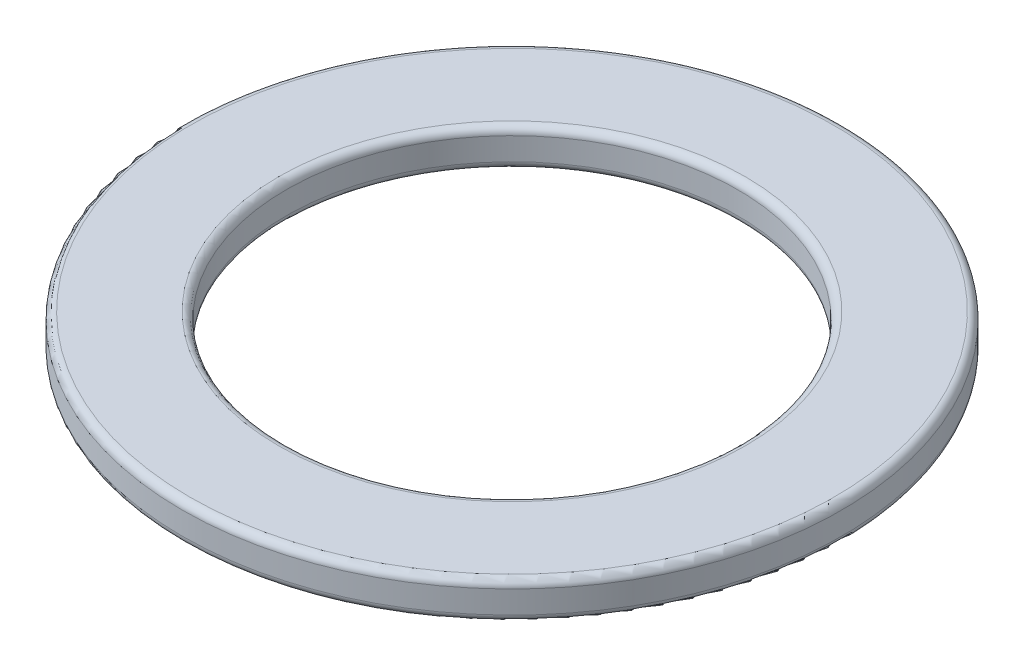
ISO-10303-21;
HEADER;
FILE_DESCRIPTION(('STEP AP214'),'2;1');
FILE_NAME('part.step','',(''),(''),'','','');
FILE_SCHEMA(('AUTOMOTIVE_DESIGN { 1 0 10303 214 1 1 1 1 }'));
ENDSEC;
DATA;
#1=APPLICATION_CONTEXT('core data for automotive mechanical design processes');
#2=APPLICATION_PROTOCOL_DEFINITION('international standard','automotive_design',2000,#1);
#3=PRODUCT_CONTEXT('',#1,'mechanical');
#4=PRODUCT('Part','Part','',(#3));
#5=PRODUCT_RELATED_PRODUCT_CATEGORY('part','',(#4));
#6=PRODUCT_DEFINITION_FORMATION('','',#4);
#7=PRODUCT_DEFINITION_CONTEXT('part definition',#1,'design');
#8=PRODUCT_DEFINITION('design','',#6,#7);
#9=PRODUCT_DEFINITION_SHAPE('','',#8);
#10=(LENGTH_UNIT() NAMED_UNIT(*) SI_UNIT(.MILLI.,.METRE.));
#11=(NAMED_UNIT(*) PLANE_ANGLE_UNIT() SI_UNIT($,.RADIAN.));
#12=(NAMED_UNIT(*) SI_UNIT($,.STERADIAN.) SOLID_ANGLE_UNIT());
#13=UNCERTAINTY_MEASURE_WITH_UNIT(LENGTH_MEASURE(1.E-05),#10,'distance_accuracy_value','');
#14=(GEOMETRIC_REPRESENTATION_CONTEXT(3) GLOBAL_UNCERTAINTY_ASSIGNED_CONTEXT((#13)) GLOBAL_UNIT_ASSIGNED_CONTEXT((#10,
#11,#12)) REPRESENTATION_CONTEXT('',''));
#15=CARTESIAN_POINT('',(0.,0.,0.));
#16=DIRECTION('',(0.,0.,1.));
#17=DIRECTION('',(1.,0.,0.));
#18=AXIS2_PLACEMENT_3D('',#15,#16,#17);
#19=CARTESIAN_POINT('',(0.,0.5,0.));
#20=DIRECTION('',(0.,1.,0.));
#21=DIRECTION('',(0.,0.,1.));
#22=AXIS2_PLACEMENT_3D('',#19,#20,#21);
#23=PLANE('',#22);
#24=CARTESIAN_POINT('',(0.,0.5,0.));
#25=DIRECTION('',(0.,1.,0.));
#26=DIRECTION('',(0.,0.,1.));
#27=AXIS2_PLACEMENT_3D('',#24,#25,#26);
#28=CIRCLE('',#27,3.1);
#29=CARTESIAN_POINT('',(0.,0.5,3.1));
#30=VERTEX_POINT('',#29);
#31=EDGE_CURVE('E10',#30,#30,#28,.F.);
#32=ORIENTED_EDGE('',*,*,#31,.T.);
#33=EDGE_LOOP('',(#32));
#34=FACE_BOUND('',#33,.T.);
#35=CARTESIAN_POINT('',(0.,0.5,0.));
#36=DIRECTION('',(0.,1.,0.));
#37=DIRECTION('',(0.,0.,1.));
#38=AXIS2_PLACEMENT_3D('',#35,#36,#37);
#39=CIRCLE('',#38,4.28);
#40=CARTESIAN_POINT('',(0.,0.5,4.28));
#41=VERTEX_POINT('',#40);
#42=EDGE_CURVE('E45',#41,#41,#39,.T.);
#43=ORIENTED_EDGE('',*,*,#42,.T.);
#44=EDGE_LOOP('',(#43));
#45=FACE_BOUND('',#44,.T.);
#46=ADVANCED_FACE('F37',(#34,#45),#23,.T.);
#47=CARTESIAN_POINT('',(0.,0.,0.));
#48=DIRECTION('',(0.,1.,0.));
#49=DIRECTION('',(0.,0.,1.));
#50=AXIS2_PLACEMENT_3D('',#47,#48,#49);
#51=PLANE('',#50);
#52=CARTESIAN_POINT('',(0.,0.,0.));
#53=DIRECTION('',(0.,1.,0.));
#54=DIRECTION('',(0.,0.,1.));
#55=AXIS2_PLACEMENT_3D('',#52,#53,#54);
#56=CIRCLE('',#55,3.1);
#57=CARTESIAN_POINT('',(0.,0.,3.1));
#58=VERTEX_POINT('',#57);
#59=EDGE_CURVE('E69',#58,#58,#56,.T.);
#60=ORIENTED_EDGE('',*,*,#59,.T.);
#61=EDGE_LOOP('',(#60));
#62=FACE_BOUND('',#61,.T.);
#63=CARTESIAN_POINT('',(0.,0.,0.));
#64=DIRECTION('',(0.,1.,0.));
#65=DIRECTION('',(0.,0.,1.));
#66=AXIS2_PLACEMENT_3D('',#63,#64,#65);
#67=CIRCLE('',#66,4.28);
#68=CARTESIAN_POINT('',(0.,0.,4.28));
#69=VERTEX_POINT('',#68);
#70=EDGE_CURVE('E73',#69,#69,#67,.F.);
#71=ORIENTED_EDGE('',*,*,#70,.T.);
#72=EDGE_LOOP('',(#71));
#73=FACE_BOUND('',#72,.T.);
#74=ADVANCED_FACE('F78',(#62,#73),#51,.F.);
#75=CARTESIAN_POINT('',(0.,0.5,0.));
#76=DIRECTION('',(0.,-1.,0.));
#77=DIRECTION('',(0.,0.,-1.));
#78=AXIS2_PLACEMENT_3D('',#75,#76,#77);
#79=CYLINDRICAL_SURFACE('',#78,4.38);
#80=CARTESIAN_POINT('',(0.,0.1,0.));
#81=DIRECTION('',(0.,1.,0.));
#82=DIRECTION('',(0.,0.,1.));
#83=AXIS2_PLACEMENT_3D('',#80,#81,#82);
#84=CIRCLE('',#83,4.38);
#85=CARTESIAN_POINT('',(0.,0.1,4.38));
#86=VERTEX_POINT('',#85);
#87=EDGE_CURVE('E50',#86,#86,#84,.T.);
#88=ORIENTED_EDGE('',*,*,#87,.T.);
#89=EDGE_LOOP('',(#88));
#90=FACE_BOUND('',#89,.T.);
#91=CARTESIAN_POINT('',(0.,0.4,0.));
#92=DIRECTION('',(0.,1.,0.));
#93=DIRECTION('',(0.,0.,1.));
#94=AXIS2_PLACEMENT_3D('',#91,#92,#93);
#95=CIRCLE('',#94,4.38);
#96=CARTESIAN_POINT('',(0.,0.4,4.38));
#97=VERTEX_POINT('',#96);
#98=EDGE_CURVE('E55',#97,#97,#95,.F.);
#99=ORIENTED_EDGE('',*,*,#98,.T.);
#100=EDGE_LOOP('',(#99));
#101=FACE_BOUND('',#100,.T.);
#102=ADVANCED_FACE('F88',(#90,#101),#79,.T.);
#103=CARTESIAN_POINT('',(0.,0.5,0.));
#104=DIRECTION('',(0.,-1.,0.));
#105=DIRECTION('',(0.,0.,-1.));
#106=AXIS2_PLACEMENT_3D('',#103,#104,#105);
#107=CYLINDRICAL_SURFACE('',#106,3.);
#108=CARTESIAN_POINT('',(0.,0.1,0.));
#109=DIRECTION('',(0.,1.,0.));
#110=DIRECTION('',(0.,0.,1.));
#111=AXIS2_PLACEMENT_3D('',#108,#109,#110);
#112=CIRCLE('',#111,3.);
#113=CARTESIAN_POINT('',(0.,0.1,3.));
#114=VERTEX_POINT('',#113);
#115=EDGE_CURVE('E61',#114,#114,#112,.F.);
#116=ORIENTED_EDGE('',*,*,#115,.T.);
#117=EDGE_LOOP('',(#116));
#118=FACE_BOUND('',#117,.T.);
#119=CARTESIAN_POINT('',(0.,0.4,0.));
#120=DIRECTION('',(0.,1.,0.));
#121=DIRECTION('',(0.,0.,1.));
#122=AXIS2_PLACEMENT_3D('',#119,#120,#121);
#123=CIRCLE('',#122,3.);
#124=CARTESIAN_POINT('',(0.,0.4,3.));
#125=VERTEX_POINT('',#124);
#126=EDGE_CURVE('E65',#125,#125,#123,.T.);
#127=ORIENTED_EDGE('',*,*,#126,.T.);
#128=EDGE_LOOP('',(#127));
#129=FACE_BOUND('',#128,.T.);
#130=ADVANCED_FACE('F91',(#118,#129),#107,.F.);
#131=CARTESIAN_POINT('',(0.,0.1,0.));
#132=DIRECTION('',(0.,1.,0.));
#133=DIRECTION('',(0.,0.,1.));
#134=AXIS2_PLACEMENT_3D('',#131,#132,#133);
#135=TOROIDAL_SURFACE('',#134,3.1,0.1);
#136=ORIENTED_EDGE('',*,*,#115,.F.);
#137=EDGE_LOOP('',(#136));
#138=FACE_BOUND('',#137,.T.);
#139=ORIENTED_EDGE('',*,*,#59,.F.);
#140=EDGE_LOOP('',(#139));
#141=FACE_BOUND('',#140,.T.);
#142=ADVANCED_FACE('F84',(#138,#141),#135,.T.);
#143=CARTESIAN_POINT('',(0.,0.1,0.));
#144=DIRECTION('',(0.,1.,0.));
#145=DIRECTION('',(0.,0.,1.));
#146=AXIS2_PLACEMENT_3D('',#143,#144,#145);
#147=TOROIDAL_SURFACE('',#146,4.28,0.1);
#148=ORIENTED_EDGE('',*,*,#70,.F.);
#149=EDGE_LOOP('',(#148));
#150=FACE_BOUND('',#149,.T.);
#151=ORIENTED_EDGE('',*,*,#87,.F.);
#152=EDGE_LOOP('',(#151));
#153=FACE_BOUND('',#152,.T.);
#154=ADVANCED_FACE('F80',(#150,#153),#147,.T.);
#155=CARTESIAN_POINT('',(0.,0.4,0.));
#156=DIRECTION('',(0.,1.,0.));
#157=DIRECTION('',(0.,0.,1.));
#158=AXIS2_PLACEMENT_3D('',#155,#156,#157);
#159=TOROIDAL_SURFACE('',#158,3.1,0.1);
#160=ORIENTED_EDGE('',*,*,#31,.F.);
#161=EDGE_LOOP('',(#160));
#162=FACE_BOUND('',#161,.T.);
#163=ORIENTED_EDGE('',*,*,#126,.F.);
#164=EDGE_LOOP('',(#163));
#165=FACE_BOUND('',#164,.T.);
#166=ADVANCED_FACE('F83',(#162,#165),#159,.T.);
#167=CARTESIAN_POINT('',(0.,0.4,0.));
#168=DIRECTION('',(0.,1.,0.));
#169=DIRECTION('',(0.,0.,1.));
#170=AXIS2_PLACEMENT_3D('',#167,#168,#169);
#171=TOROIDAL_SURFACE('',#170,4.28,0.1);
#172=ORIENTED_EDGE('',*,*,#98,.F.);
#173=EDGE_LOOP('',(#172));
#174=FACE_BOUND('',#173,.T.);
#175=ORIENTED_EDGE('',*,*,#42,.F.);
#176=EDGE_LOOP('',(#175));
#177=FACE_BOUND('',#176,.T.);
#178=ADVANCED_FACE('F39',(#174,#177),#171,.T.);
#179=CLOSED_SHELL('',(#46,#74,#102,#130,#142,#154,#166,#178));
#180=MANIFOLD_SOLID_BREP('B2',#179);
#181=ADVANCED_BREP_SHAPE_REPRESENTATION('',(#18,#180),#14);
#182=SHAPE_DEFINITION_REPRESENTATION(#9,#181);
ENDSEC;
END-ISO-10303-21;
